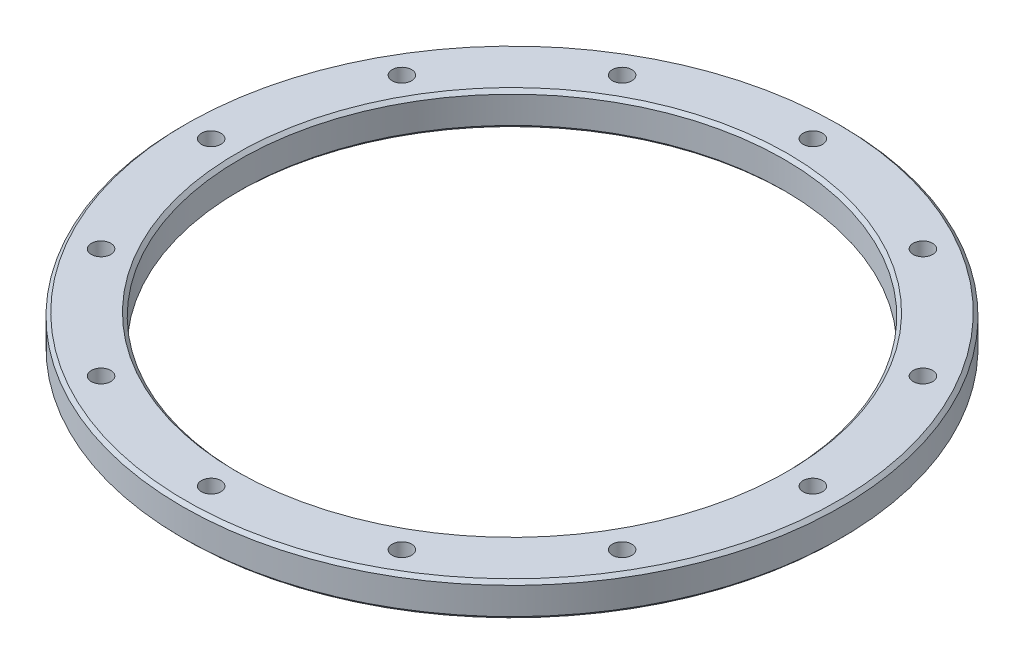
ISO-10303-21;
HEADER;
FILE_DESCRIPTION(('STEP AP214'),'2;1');
FILE_NAME('part.step','',(''),(''),'','','');
FILE_SCHEMA(('AUTOMOTIVE_DESIGN { 1 0 10303 214 1 1 1 1 }'));
ENDSEC;
DATA;
#1=APPLICATION_CONTEXT('core data for automotive mechanical design processes');
#2=APPLICATION_PROTOCOL_DEFINITION('international standard','automotive_design',2000,#1);
#3=PRODUCT_CONTEXT('',#1,'mechanical');
#4=PRODUCT('Part','Part','',(#3));
#5=PRODUCT_RELATED_PRODUCT_CATEGORY('part','',(#4));
#6=PRODUCT_DEFINITION_FORMATION('','',#4);
#7=PRODUCT_DEFINITION_CONTEXT('part definition',#1,'design');
#8=PRODUCT_DEFINITION('design','',#6,#7);
#9=PRODUCT_DEFINITION_SHAPE('','',#8);
#10=(LENGTH_UNIT() NAMED_UNIT(*) SI_UNIT(.MILLI.,.METRE.));
#11=(NAMED_UNIT(*) PLANE_ANGLE_UNIT() SI_UNIT($,.RADIAN.));
#12=(NAMED_UNIT(*) SI_UNIT($,.STERADIAN.) SOLID_ANGLE_UNIT());
#13=UNCERTAINTY_MEASURE_WITH_UNIT(LENGTH_MEASURE(1.E-05),#10,'distance_accuracy_value','');
#14=(GEOMETRIC_REPRESENTATION_CONTEXT(3) GLOBAL_UNCERTAINTY_ASSIGNED_CONTEXT((#13)) GLOBAL_UNIT_ASSIGNED_CONTEXT((#10,
#11,#12)) REPRESENTATION_CONTEXT('',''));
#15=CARTESIAN_POINT('',(0.,0.,0.));
#16=DIRECTION('',(0.,0.,1.));
#17=DIRECTION('',(1.,0.,0.));
#18=AXIS2_PLACEMENT_3D('',#15,#16,#17);
#19=CARTESIAN_POINT('',(0.,0.,0.));
#20=DIRECTION('',(0.,1.,0.));
#21=DIRECTION('',(0.,0.,1.));
#22=AXIS2_PLACEMENT_3D('',#19,#20,#21);
#23=CYLINDRICAL_SURFACE('',#22,61.9125);
#24=CARTESIAN_POINT('',(0.,5.71500000000006,0.));
#25=DIRECTION('',(0.,-1.,0.));
#26=DIRECTION('',(0.,0.,-1.));
#27=AXIS2_PLACEMENT_3D('',#24,#25,#26);
#28=CIRCLE('',#27,61.9125);
#29=CARTESIAN_POINT('',(0.,5.71500000000006,-61.9125));
#30=VERTEX_POINT('',#29);
#31=EDGE_CURVE('E10',#30,#30,#28,.T.);
#32=ORIENTED_EDGE('',*,*,#31,.T.);
#33=EDGE_LOOP('',(#32));
#34=FACE_BOUND('',#33,.T.);
#35=CARTESIAN_POINT('',(0.,0.635000000000059,0.));
#36=DIRECTION('',(0.,-1.,0.));
#37=DIRECTION('',(0.,0.,-1.));
#38=AXIS2_PLACEMENT_3D('',#35,#36,#37);
#39=CIRCLE('',#38,61.9125);
#40=CARTESIAN_POINT('',(0.,0.635000000000059,-61.9125));
#41=VERTEX_POINT('',#40);
#42=EDGE_CURVE('E57',#41,#41,#39,.F.);
#43=ORIENTED_EDGE('',*,*,#42,.T.);
#44=EDGE_LOOP('',(#43));
#45=FACE_BOUND('',#44,.T.);
#46=ADVANCED_FACE('F41',(#34,#45),#23,.T.);
#47=CARTESIAN_POINT('',(0.,0.,0.));
#48=DIRECTION('',(0.,-1.,0.));
#49=DIRECTION('',(0.,0.,-1.));
#50=AXIS2_PLACEMENT_3D('',#47,#48,#49);
#51=PLANE('',#50);
#52=CARTESIAN_POINT('',(0.,0.,0.));
#53=DIRECTION('',(0.,-1.,0.));
#54=DIRECTION('',(0.,0.,-1.));
#55=AXIS2_PLACEMENT_3D('',#52,#53,#54);
#56=CIRCLE('',#55,61.2774999999999);
#57=CARTESIAN_POINT('',(0.,0.,-61.2774999999999));
#58=VERTEX_POINT('',#57);
#59=EDGE_CURVE('E53',#58,#58,#56,.T.);
#60=ORIENTED_EDGE('',*,*,#59,.T.);
#61=EDGE_LOOP('',(#60));
#62=FACE_BOUND('',#61,.T.);
#63=CARTESIAN_POINT('',(-48.9434256948766,0.,28.2575000000015));
#64=DIRECTION('',(0.,-1.,0.));
#65=DIRECTION('',(0.,0.,-1.));
#66=AXIS2_PLACEMENT_3D('',#63,#64,#65);
#67=CIRCLE('',#66,1.83000000000001);
#68=CARTESIAN_POINT('',(-48.9434256948766,0.,26.4275000000015));
#69=VERTEX_POINT('',#68);
#70=EDGE_CURVE('E143',#69,#69,#67,.T.);
#71=ORIENTED_EDGE('',*,*,#70,.F.);
#72=EDGE_LOOP('',(#71));
#73=FACE_BOUND('',#72,.T.);
#74=CARTESIAN_POINT('',(-56.515,0.,1.63410951437015E-12));
#75=DIRECTION('',(0.,-1.,0.));
#76=DIRECTION('',(0.,0.,-1.));
#77=AXIS2_PLACEMENT_3D('',#74,#75,#76);
#78=CIRCLE('',#77,1.83000000000001);
#79=CARTESIAN_POINT('',(-56.515,0.,-1.82999999999838));
#80=VERTEX_POINT('',#79);
#81=EDGE_CURVE('E137',#80,#80,#78,.T.);
#82=ORIENTED_EDGE('',*,*,#81,.F.);
#83=EDGE_LOOP('',(#82));
#84=FACE_BOUND('',#83,.T.);
#85=CARTESIAN_POINT('',(-48.9434256948783,0.,-28.2574999999987));
#86=DIRECTION('',(0.,-1.,0.));
#87=DIRECTION('',(0.,0.,-1.));
#88=AXIS2_PLACEMENT_3D('',#85,#86,#87);
#89=CIRCLE('',#88,1.83000000000001);
#90=CARTESIAN_POINT('',(-48.9434256948783,0.,-30.0874999999987));
#91=VERTEX_POINT('',#90);
#92=EDGE_CURVE('E131',#91,#91,#89,.T.);
#93=ORIENTED_EDGE('',*,*,#92,.F.);
#94=EDGE_LOOP('',(#93));
#95=FACE_BOUND('',#94,.T.);
#96=CARTESIAN_POINT('',(-28.2575000000011,0.,-48.9434256948769));
#97=DIRECTION('',(0.,-1.,0.));
#98=DIRECTION('',(0.,0.,-1.));
#99=AXIS2_PLACEMENT_3D('',#96,#97,#98);
#100=CIRCLE('',#99,1.83000000000001);
#101=CARTESIAN_POINT('',(-28.2575000000011,0.,-50.7734256948769));
#102=VERTEX_POINT('',#101);
#103=EDGE_CURVE('E125',#102,#102,#100,.T.);
#104=ORIENTED_EDGE('',*,*,#103,.F.);
#105=EDGE_LOOP('',(#104));
#106=FACE_BOUND('',#105,.T.);
#107=CARTESIAN_POINT('',(-1.13450915328883E-12,0.,-56.515));
#108=DIRECTION('',(0.,-1.,0.));
#109=DIRECTION('',(0.,0.,-1.));
#110=AXIS2_PLACEMENT_3D('',#107,#108,#109);
#111=CIRCLE('',#110,1.83000000000001);
#112=CARTESIAN_POINT('',(-1.13450915328883E-12,0.,-58.345));
#113=VERTEX_POINT('',#112);
#114=EDGE_CURVE('E119',#113,#113,#111,.T.);
#115=ORIENTED_EDGE('',*,*,#114,.F.);
#116=EDGE_LOOP('',(#115));
#117=FACE_BOUND('',#116,.T.);
#118=CARTESIAN_POINT('',(28.2575,0.,-48.9434256948775));
#119=DIRECTION('',(0.,-1.,0.));
#120=DIRECTION('',(0.,0.,-1.));
#121=AXIS2_PLACEMENT_3D('',#118,#119,#120);
#122=CIRCLE('',#121,1.83000000000001);
#123=CARTESIAN_POINT('',(28.2575,0.,-50.7734256948775));
#124=VERTEX_POINT('',#123);
#125=EDGE_CURVE('E113',#124,#124,#122,.T.);
#126=ORIENTED_EDGE('',*,*,#125,.F.);
#127=EDGE_LOOP('',(#126));
#128=FACE_BOUND('',#127,.T.);
#129=CARTESIAN_POINT('',(48.9434256948771,0.,-28.2575000000007));
#130=DIRECTION('',(0.,-1.,0.));
#131=DIRECTION('',(0.,0.,-1.));
#132=AXIS2_PLACEMENT_3D('',#129,#130,#131);
#133=CIRCLE('',#132,1.83000000000001);
#134=CARTESIAN_POINT('',(48.9434256948771,0.,-30.0875000000007));
#135=VERTEX_POINT('',#134);
#136=EDGE_CURVE('E107',#135,#135,#133,.T.);
#137=ORIENTED_EDGE('',*,*,#136,.F.);
#138=EDGE_LOOP('',(#137));
#139=FACE_BOUND('',#138,.T.);
#140=CARTESIAN_POINT('',(56.515,0.,-6.41847686111419E-13));
#141=DIRECTION('',(0.,-1.,0.));
#142=DIRECTION('',(0.,0.,-1.));
#143=AXIS2_PLACEMENT_3D('',#140,#141,#142);
#144=CIRCLE('',#143,1.83000000000001);
#145=CARTESIAN_POINT('',(56.515,0.,-1.83000000000065));
#146=VERTEX_POINT('',#145);
#147=EDGE_CURVE('E101',#146,#146,#144,.T.);
#148=ORIENTED_EDGE('',*,*,#147,.F.);
#149=EDGE_LOOP('',(#148));
#150=FACE_BOUND('',#149,.T.);
#151=CARTESIAN_POINT('',(48.9434256948778,0.,28.2574999999996));
#152=DIRECTION('',(0.,-1.,0.));
#153=DIRECTION('',(0.,0.,-1.));
#154=AXIS2_PLACEMENT_3D('',#151,#152,#153);
#155=CIRCLE('',#154,1.83000000000001);
#156=CARTESIAN_POINT('',(48.9434256948778,0.,26.4274999999996));
#157=VERTEX_POINT('',#156);
#158=EDGE_CURVE('E95',#157,#157,#155,.T.);
#159=ORIENTED_EDGE('',*,*,#158,.F.);
#160=EDGE_LOOP('',(#159));
#161=FACE_BOUND('',#160,.T.);
#162=CARTESIAN_POINT('',(28.2575000000002,0.,48.9434256948774));
#163=DIRECTION('',(0.,-1.,0.));
#164=DIRECTION('',(0.,0.,-1.));
#165=AXIS2_PLACEMENT_3D('',#162,#163,#164);
#166=CIRCLE('',#165,1.83000000000001);
#167=CARTESIAN_POINT('',(28.2575000000002,0.,47.1134256948773));
#168=VERTEX_POINT('',#167);
#169=EDGE_CURVE('E89',#168,#168,#166,.T.);
#170=ORIENTED_EDGE('',*,*,#169,.F.);
#171=EDGE_LOOP('',(#170));
#172=FACE_BOUND('',#171,.T.);
#173=CARTESIAN_POINT('',(1.42247325030098E-13,0.,56.515));
#174=DIRECTION('',(0.,-1.,0.));
#175=DIRECTION('',(0.,0.,-1.));
#176=AXIS2_PLACEMENT_3D('',#173,#174,#175);
#177=CIRCLE('',#176,1.83000000000001);
#178=CARTESIAN_POINT('',(1.42247325030098E-13,0.,54.6849999999999));
#179=VERTEX_POINT('',#178);
#180=EDGE_CURVE('E83',#179,#179,#177,.T.);
#181=ORIENTED_EDGE('',*,*,#180,.F.);
#182=EDGE_LOOP('',(#181));
#183=FACE_BOUND('',#182,.T.);
#184=CARTESIAN_POINT('',(-28.2575,0.,48.9434256948775));
#185=DIRECTION('',(0.,-1.,0.));
#186=DIRECTION('',(0.,0.,-1.));
#187=AXIS2_PLACEMENT_3D('',#184,#185,#186);
#188=CIRCLE('',#187,1.83000000000001);
#189=CARTESIAN_POINT('',(-28.2575,0.,47.1134256948775));
#190=VERTEX_POINT('',#189);
#191=EDGE_CURVE('E77',#190,#190,#188,.T.);
#192=ORIENTED_EDGE('',*,*,#191,.F.);
#193=EDGE_LOOP('',(#192));
#194=FACE_BOUND('',#193,.T.);
#195=CARTESIAN_POINT('',(0.,0.,0.));
#196=DIRECTION('',(0.,-1.,0.));
#197=DIRECTION('',(0.,0.,-1.));
#198=AXIS2_PLACEMENT_3D('',#195,#196,#197);
#199=CIRCLE('',#198,51.7524999999999);
#200=CARTESIAN_POINT('',(0.,0.,-51.7524999999999));
#201=VERTEX_POINT('',#200);
#202=EDGE_CURVE('E71',#201,#201,#199,.F.);
#203=ORIENTED_EDGE('',*,*,#202,.T.);
#204=EDGE_LOOP('',(#203));
#205=FACE_BOUND('',#204,.T.);
#206=ADVANCED_FACE('F149',(#62,#73,#84,#95,#106,#117,#128,#139,#150,#161,#172,#183,#194,#205),
#51,.T.);
#207=CARTESIAN_POINT('',(0.,6.35,0.));
#208=DIRECTION('',(0.,-1.,0.));
#209=DIRECTION('',(0.,0.,-1.));
#210=AXIS2_PLACEMENT_3D('',#207,#208,#209);
#211=PLANE('',#210);
#212=CARTESIAN_POINT('',(0.,6.35,0.));
#213=DIRECTION('',(0.,-1.,0.));
#214=DIRECTION('',(0.,0.,-1.));
#215=AXIS2_PLACEMENT_3D('',#212,#213,#214);
#216=CIRCLE('',#215,61.2775000000001);
#217=CARTESIAN_POINT('',(0.,6.35,-61.2775000000001));
#218=VERTEX_POINT('',#217);
#219=EDGE_CURVE('E49',#218,#218,#216,.F.);
#220=ORIENTED_EDGE('',*,*,#219,.T.);
#221=EDGE_LOOP('',(#220));
#222=FACE_BOUND('',#221,.T.);
#223=CARTESIAN_POINT('',(-48.9434256948766,6.34999999999999,28.2575000000015));
#224=DIRECTION('',(0.,-1.,0.));
#225=DIRECTION('',(0.,0.,-1.));
#226=AXIS2_PLACEMENT_3D('',#223,#224,#225);
#227=CIRCLE('',#226,1.83000000000001);
#228=CARTESIAN_POINT('',(-48.9434256948766,6.34999999999999,26.4275000000015));
#229=VERTEX_POINT('',#228);
#230=EDGE_CURVE('E140',#229,#229,#227,.T.);
#231=ORIENTED_EDGE('',*,*,#230,.T.);
#232=EDGE_LOOP('',(#231));
#233=FACE_BOUND('',#232,.T.);
#234=CARTESIAN_POINT('',(-56.515,6.34999999999999,1.63410951437015E-12));
#235=DIRECTION('',(0.,-1.,0.));
#236=DIRECTION('',(0.,0.,-1.));
#237=AXIS2_PLACEMENT_3D('',#234,#235,#236);
#238=CIRCLE('',#237,1.83000000000001);
#239=CARTESIAN_POINT('',(-56.515,6.34999999999999,-1.82999999999838));
#240=VERTEX_POINT('',#239);
#241=EDGE_CURVE('E134',#240,#240,#238,.T.);
#242=ORIENTED_EDGE('',*,*,#241,.T.);
#243=EDGE_LOOP('',(#242));
#244=FACE_BOUND('',#243,.T.);
#245=CARTESIAN_POINT('',(-48.9434256948783,6.34999999999999,-28.2574999999987));
#246=DIRECTION('',(0.,-1.,0.));
#247=DIRECTION('',(0.,0.,-1.));
#248=AXIS2_PLACEMENT_3D('',#245,#246,#247);
#249=CIRCLE('',#248,1.83000000000001);
#250=CARTESIAN_POINT('',(-48.9434256948783,6.34999999999999,-30.0874999999987));
#251=VERTEX_POINT('',#250);
#252=EDGE_CURVE('E128',#251,#251,#249,.T.);
#253=ORIENTED_EDGE('',*,*,#252,.T.);
#254=EDGE_LOOP('',(#253));
#255=FACE_BOUND('',#254,.T.);
#256=CARTESIAN_POINT('',(-28.2575000000011,6.34999999999999,-48.9434256948769));
#257=DIRECTION('',(0.,-1.,0.));
#258=DIRECTION('',(0.,0.,-1.));
#259=AXIS2_PLACEMENT_3D('',#256,#257,#258);
#260=CIRCLE('',#259,1.83000000000001);
#261=CARTESIAN_POINT('',(-28.2575000000011,6.34999999999999,-50.7734256948769));
#262=VERTEX_POINT('',#261);
#263=EDGE_CURVE('E122',#262,#262,#260,.T.);
#264=ORIENTED_EDGE('',*,*,#263,.T.);
#265=EDGE_LOOP('',(#264));
#266=FACE_BOUND('',#265,.T.);
#267=CARTESIAN_POINT('',(-1.13450915328883E-12,6.34999999999999,-56.515));
#268=DIRECTION('',(0.,-1.,0.));
#269=DIRECTION('',(0.,0.,-1.));
#270=AXIS2_PLACEMENT_3D('',#267,#268,#269);
#271=CIRCLE('',#270,1.83000000000001);
#272=CARTESIAN_POINT('',(-1.13450915328883E-12,6.34999999999999,-58.345));
#273=VERTEX_POINT('',#272);
#274=EDGE_CURVE('E116',#273,#273,#271,.T.);
#275=ORIENTED_EDGE('',*,*,#274,.T.);
#276=EDGE_LOOP('',(#275));
#277=FACE_BOUND('',#276,.T.);
#278=CARTESIAN_POINT('',(28.2575,6.34999999999999,-48.9434256948775));
#279=DIRECTION('',(0.,-1.,0.));
#280=DIRECTION('',(0.,0.,-1.));
#281=AXIS2_PLACEMENT_3D('',#278,#279,#280);
#282=CIRCLE('',#281,1.83000000000001);
#283=CARTESIAN_POINT('',(28.2575,6.34999999999999,-50.7734256948775));
#284=VERTEX_POINT('',#283);
#285=EDGE_CURVE('E110',#284,#284,#282,.T.);
#286=ORIENTED_EDGE('',*,*,#285,.T.);
#287=EDGE_LOOP('',(#286));
#288=FACE_BOUND('',#287,.T.);
#289=CARTESIAN_POINT('',(48.9434256948771,6.34999999999999,-28.2575000000007));
#290=DIRECTION('',(0.,-1.,0.));
#291=DIRECTION('',(0.,0.,-1.));
#292=AXIS2_PLACEMENT_3D('',#289,#290,#291);
#293=CIRCLE('',#292,1.83000000000001);
#294=CARTESIAN_POINT('',(48.9434256948771,6.34999999999999,-30.0875000000007));
#295=VERTEX_POINT('',#294);
#296=EDGE_CURVE('E104',#295,#295,#293,.T.);
#297=ORIENTED_EDGE('',*,*,#296,.T.);
#298=EDGE_LOOP('',(#297));
#299=FACE_BOUND('',#298,.T.);
#300=CARTESIAN_POINT('',(56.515,6.34999999999999,-6.41847686111419E-13));
#301=DIRECTION('',(0.,-1.,0.));
#302=DIRECTION('',(0.,0.,-1.));
#303=AXIS2_PLACEMENT_3D('',#300,#301,#302);
#304=CIRCLE('',#303,1.83000000000001);
#305=CARTESIAN_POINT('',(56.515,6.34999999999999,-1.83000000000065));
#306=VERTEX_POINT('',#305);
#307=EDGE_CURVE('E98',#306,#306,#304,.T.);
#308=ORIENTED_EDGE('',*,*,#307,.T.);
#309=EDGE_LOOP('',(#308));
#310=FACE_BOUND('',#309,.T.);
#311=CARTESIAN_POINT('',(48.9434256948778,6.34999999999999,28.2574999999996));
#312=DIRECTION('',(0.,-1.,0.));
#313=DIRECTION('',(0.,0.,-1.));
#314=AXIS2_PLACEMENT_3D('',#311,#312,#313);
#315=CIRCLE('',#314,1.83000000000001);
#316=CARTESIAN_POINT('',(48.9434256948778,6.34999999999999,26.4274999999996));
#317=VERTEX_POINT('',#316);
#318=EDGE_CURVE('E92',#317,#317,#315,.T.);
#319=ORIENTED_EDGE('',*,*,#318,.T.);
#320=EDGE_LOOP('',(#319));
#321=FACE_BOUND('',#320,.T.);
#322=CARTESIAN_POINT('',(28.2575000000002,6.34999999999999,48.9434256948774));
#323=DIRECTION('',(0.,-1.,0.));
#324=DIRECTION('',(0.,0.,-1.));
#325=AXIS2_PLACEMENT_3D('',#322,#323,#324);
#326=CIRCLE('',#325,1.83000000000001);
#327=CARTESIAN_POINT('',(28.2575000000002,6.34999999999999,47.1134256948773));
#328=VERTEX_POINT('',#327);
#329=EDGE_CURVE('E86',#328,#328,#326,.T.);
#330=ORIENTED_EDGE('',*,*,#329,.T.);
#331=EDGE_LOOP('',(#330));
#332=FACE_BOUND('',#331,.T.);
#333=CARTESIAN_POINT('',(1.42247325030098E-13,6.34999999999999,56.515));
#334=DIRECTION('',(0.,-1.,0.));
#335=DIRECTION('',(0.,0.,-1.));
#336=AXIS2_PLACEMENT_3D('',#333,#334,#335);
#337=CIRCLE('',#336,1.83000000000001);
#338=CARTESIAN_POINT('',(1.42247325030098E-13,6.34999999999999,54.6849999999999));
#339=VERTEX_POINT('',#338);
#340=EDGE_CURVE('E80',#339,#339,#337,.T.);
#341=ORIENTED_EDGE('',*,*,#340,.T.);
#342=EDGE_LOOP('',(#341));
#343=FACE_BOUND('',#342,.T.);
#344=CARTESIAN_POINT('',(-28.2575,6.34999999999999,48.9434256948775));
#345=DIRECTION('',(0.,-1.,0.));
#346=DIRECTION('',(0.,0.,-1.));
#347=AXIS2_PLACEMENT_3D('',#344,#345,#346);
#348=CIRCLE('',#347,1.83000000000001);
#349=CARTESIAN_POINT('',(-28.2575,6.34999999999999,47.1134256948775));
#350=VERTEX_POINT('',#349);
#351=EDGE_CURVE('E74',#350,#350,#348,.T.);
#352=ORIENTED_EDGE('',*,*,#351,.T.);
#353=EDGE_LOOP('',(#352));
#354=FACE_BOUND('',#353,.T.);
#355=CARTESIAN_POINT('',(0.,6.35,0.));
#356=DIRECTION('',(0.,-1.,0.));
#357=DIRECTION('',(0.,0.,-1.));
#358=AXIS2_PLACEMENT_3D('',#355,#356,#357);
#359=CIRCLE('',#358,51.7525000000001);
#360=CARTESIAN_POINT('',(0.,6.35,-51.7525000000001));
#361=VERTEX_POINT('',#360);
#362=EDGE_CURVE('E62',#361,#361,#359,.T.);
#363=ORIENTED_EDGE('',*,*,#362,.T.);
#364=EDGE_LOOP('',(#363));
#365=FACE_BOUND('',#364,.T.);
#366=ADVANCED_FACE('F152',(#222,#233,#244,#255,#266,#277,#288,#299,#310,#321,#332,#343,#354,
#365),#211,.F.);
#367=CARTESIAN_POINT('',(0.,0.,0.));
#368=DIRECTION('',(0.,1.,0.));
#369=DIRECTION('',(0.,0.,1.));
#370=AXIS2_PLACEMENT_3D('',#367,#368,#369);
#371=CYLINDRICAL_SURFACE('',#370,51.1175);
#372=CARTESIAN_POINT('',(0.,5.71499999999997,0.));
#373=DIRECTION('',(0.,-1.,0.));
#374=DIRECTION('',(0.,0.,-1.));
#375=AXIS2_PLACEMENT_3D('',#372,#373,#374);
#376=CIRCLE('',#375,51.1175);
#377=CARTESIAN_POINT('',(0.,5.71499999999997,-51.1175));
#378=VERTEX_POINT('',#377);
#379=EDGE_CURVE('E65',#378,#378,#376,.F.);
#380=ORIENTED_EDGE('',*,*,#379,.T.);
#381=EDGE_LOOP('',(#380));
#382=FACE_BOUND('',#381,.T.);
#383=CARTESIAN_POINT('',(0.,0.634999999999934,0.));
#384=DIRECTION('',(0.,-1.,0.));
#385=DIRECTION('',(0.,0.,-1.));
#386=AXIS2_PLACEMENT_3D('',#383,#384,#385);
#387=CIRCLE('',#386,51.1175);
#388=CARTESIAN_POINT('',(0.,0.634999999999934,-51.1175));
#389=VERTEX_POINT('',#388);
#390=EDGE_CURVE('E68',#389,#389,#387,.T.);
#391=ORIENTED_EDGE('',*,*,#390,.T.);
#392=EDGE_LOOP('',(#391));
#393=FACE_BOUND('',#392,.T.);
#394=ADVANCED_FACE('F182',(#382,#393),#371,.F.);
#395=CARTESIAN_POINT('',(0.,0.,0.));
#396=DIRECTION('',(0.,-1.,0.));
#397=DIRECTION('',(0.,0.,-1.));
#398=AXIS2_PLACEMENT_3D('',#395,#396,#397);
#399=CONICAL_SURFACE('',#398,51.7524999999999,0.785398163397448);
#400=ORIENTED_EDGE('',*,*,#390,.F.);
#401=EDGE_LOOP('',(#400));
#402=FACE_BOUND('',#401,.T.);
#403=ORIENTED_EDGE('',*,*,#202,.F.);
#404=EDGE_LOOP('',(#403));
#405=FACE_BOUND('',#404,.T.);
#406=ADVANCED_FACE('F179',(#402,#405),#399,.F.);
#407=CARTESIAN_POINT('',(0.,5.71499999999997,0.));
#408=DIRECTION('',(0.,1.,0.));
#409=DIRECTION('',(0.,0.,1.));
#410=AXIS2_PLACEMENT_3D('',#407,#408,#409);
#411=CONICAL_SURFACE('',#410,51.1175,0.78539816339747);
#412=ORIENTED_EDGE('',*,*,#362,.F.);
#413=EDGE_LOOP('',(#412));
#414=FACE_BOUND('',#413,.T.);
#415=ORIENTED_EDGE('',*,*,#379,.F.);
#416=EDGE_LOOP('',(#415));
#417=FACE_BOUND('',#416,.T.);
#418=ADVANCED_FACE('F181',(#414,#417),#411,.F.);
#419=CARTESIAN_POINT('',(-28.2575,0.,48.9434256948775));
#420=DIRECTION('',(0.,-1.,0.));
#421=DIRECTION('',(0.,0.,-1.));
#422=AXIS2_PLACEMENT_3D('',#419,#420,#421);
#423=CYLINDRICAL_SURFACE('',#422,1.83000000000001);
#424=ORIENTED_EDGE('',*,*,#351,.F.);
#425=EDGE_LOOP('',(#424));
#426=FACE_BOUND('',#425,.T.);
#427=ORIENTED_EDGE('',*,*,#191,.T.);
#428=EDGE_LOOP('',(#427));
#429=FACE_BOUND('',#428,.T.);
#430=ADVANCED_FACE('F189',(#426,#429),#423,.F.);
#431=CARTESIAN_POINT('',(1.42247325030098E-13,0.,56.515));
#432=DIRECTION('',(0.,-1.,0.));
#433=DIRECTION('',(0.,0.,-1.));
#434=AXIS2_PLACEMENT_3D('',#431,#432,#433);
#435=CYLINDRICAL_SURFACE('',#434,1.83000000000001);
#436=ORIENTED_EDGE('',*,*,#340,.F.);
#437=EDGE_LOOP('',(#436));
#438=FACE_BOUND('',#437,.T.);
#439=ORIENTED_EDGE('',*,*,#180,.T.);
#440=EDGE_LOOP('',(#439));
#441=FACE_BOUND('',#440,.T.);
#442=ADVANCED_FACE('F206',(#438,#441),#435,.F.);
#443=CARTESIAN_POINT('',(28.2575000000002,0.,48.9434256948774));
#444=DIRECTION('',(0.,-1.,0.));
#445=DIRECTION('',(0.,0.,-1.));
#446=AXIS2_PLACEMENT_3D('',#443,#444,#445);
#447=CYLINDRICAL_SURFACE('',#446,1.83000000000001);
#448=ORIENTED_EDGE('',*,*,#329,.F.);
#449=EDGE_LOOP('',(#448));
#450=FACE_BOUND('',#449,.T.);
#451=ORIENTED_EDGE('',*,*,#169,.T.);
#452=EDGE_LOOP('',(#451));
#453=FACE_BOUND('',#452,.T.);
#454=ADVANCED_FACE('F210',(#450,#453),#447,.F.);
#455=CARTESIAN_POINT('',(48.9434256948778,0.,28.2574999999996));
#456=DIRECTION('',(0.,-1.,0.));
#457=DIRECTION('',(0.,0.,-1.));
#458=AXIS2_PLACEMENT_3D('',#455,#456,#457);
#459=CYLINDRICAL_SURFACE('',#458,1.83000000000001);
#460=ORIENTED_EDGE('',*,*,#318,.F.);
#461=EDGE_LOOP('',(#460));
#462=FACE_BOUND('',#461,.T.);
#463=ORIENTED_EDGE('',*,*,#158,.T.);
#464=EDGE_LOOP('',(#463));
#465=FACE_BOUND('',#464,.T.);
#466=ADVANCED_FACE('F214',(#462,#465),#459,.F.);
#467=CARTESIAN_POINT('',(56.515,0.,-6.41847686111419E-13));
#468=DIRECTION('',(0.,-1.,0.));
#469=DIRECTION('',(0.,0.,-1.));
#470=AXIS2_PLACEMENT_3D('',#467,#468,#469);
#471=CYLINDRICAL_SURFACE('',#470,1.83000000000001);
#472=ORIENTED_EDGE('',*,*,#307,.F.);
#473=EDGE_LOOP('',(#472));
#474=FACE_BOUND('',#473,.T.);
#475=ORIENTED_EDGE('',*,*,#147,.T.);
#476=EDGE_LOOP('',(#475));
#477=FACE_BOUND('',#476,.T.);
#478=ADVANCED_FACE('F218',(#474,#477),#471,.F.);
#479=CARTESIAN_POINT('',(48.9434256948771,0.,-28.2575000000007));
#480=DIRECTION('',(0.,-1.,0.));
#481=DIRECTION('',(0.,0.,-1.));
#482=AXIS2_PLACEMENT_3D('',#479,#480,#481);
#483=CYLINDRICAL_SURFACE('',#482,1.83000000000001);
#484=ORIENTED_EDGE('',*,*,#296,.F.);
#485=EDGE_LOOP('',(#484));
#486=FACE_BOUND('',#485,.T.);
#487=ORIENTED_EDGE('',*,*,#136,.T.);
#488=EDGE_LOOP('',(#487));
#489=FACE_BOUND('',#488,.T.);
#490=ADVANCED_FACE('F222',(#486,#489),#483,.F.);
#491=CARTESIAN_POINT('',(28.2575,0.,-48.9434256948775));
#492=DIRECTION('',(0.,-1.,0.));
#493=DIRECTION('',(0.,0.,-1.));
#494=AXIS2_PLACEMENT_3D('',#491,#492,#493);
#495=CYLINDRICAL_SURFACE('',#494,1.83000000000001);
#496=ORIENTED_EDGE('',*,*,#285,.F.);
#497=EDGE_LOOP('',(#496));
#498=FACE_BOUND('',#497,.T.);
#499=ORIENTED_EDGE('',*,*,#125,.T.);
#500=EDGE_LOOP('',(#499));
#501=FACE_BOUND('',#500,.T.);
#502=ADVANCED_FACE('F226',(#498,#501),#495,.F.);
#503=CARTESIAN_POINT('',(-1.13450915328883E-12,0.,-56.515));
#504=DIRECTION('',(0.,-1.,0.));
#505=DIRECTION('',(0.,0.,-1.));
#506=AXIS2_PLACEMENT_3D('',#503,#504,#505);
#507=CYLINDRICAL_SURFACE('',#506,1.83000000000001);
#508=ORIENTED_EDGE('',*,*,#274,.F.);
#509=EDGE_LOOP('',(#508));
#510=FACE_BOUND('',#509,.T.);
#511=ORIENTED_EDGE('',*,*,#114,.T.);
#512=EDGE_LOOP('',(#511));
#513=FACE_BOUND('',#512,.T.);
#514=ADVANCED_FACE('F230',(#510,#513),#507,.F.);
#515=CARTESIAN_POINT('',(-28.2575000000011,0.,-48.9434256948769));
#516=DIRECTION('',(0.,-1.,0.));
#517=DIRECTION('',(0.,0.,-1.));
#518=AXIS2_PLACEMENT_3D('',#515,#516,#517);
#519=CYLINDRICAL_SURFACE('',#518,1.83000000000001);
#520=ORIENTED_EDGE('',*,*,#263,.F.);
#521=EDGE_LOOP('',(#520));
#522=FACE_BOUND('',#521,.T.);
#523=ORIENTED_EDGE('',*,*,#103,.T.);
#524=EDGE_LOOP('',(#523));
#525=FACE_BOUND('',#524,.T.);
#526=ADVANCED_FACE('F234',(#522,#525),#519,.F.);
#527=CARTESIAN_POINT('',(-48.9434256948783,0.,-28.2574999999987));
#528=DIRECTION('',(0.,-1.,0.));
#529=DIRECTION('',(0.,0.,-1.));
#530=AXIS2_PLACEMENT_3D('',#527,#528,#529);
#531=CYLINDRICAL_SURFACE('',#530,1.83000000000001);
#532=ORIENTED_EDGE('',*,*,#252,.F.);
#533=EDGE_LOOP('',(#532));
#534=FACE_BOUND('',#533,.T.);
#535=ORIENTED_EDGE('',*,*,#92,.T.);
#536=EDGE_LOOP('',(#535));
#537=FACE_BOUND('',#536,.T.);
#538=ADVANCED_FACE('F238',(#534,#537),#531,.F.);
#539=CARTESIAN_POINT('',(-56.515,0.,1.63410951437015E-12));
#540=DIRECTION('',(0.,-1.,0.));
#541=DIRECTION('',(0.,0.,-1.));
#542=AXIS2_PLACEMENT_3D('',#539,#540,#541);
#543=CYLINDRICAL_SURFACE('',#542,1.83000000000001);
#544=ORIENTED_EDGE('',*,*,#241,.F.);
#545=EDGE_LOOP('',(#544));
#546=FACE_BOUND('',#545,.T.);
#547=ORIENTED_EDGE('',*,*,#81,.T.);
#548=EDGE_LOOP('',(#547));
#549=FACE_BOUND('',#548,.T.);
#550=ADVANCED_FACE('F242',(#546,#549),#543,.F.);
#551=CARTESIAN_POINT('',(-48.9434256948766,0.,28.2575000000015));
#552=DIRECTION('',(0.,-1.,0.));
#553=DIRECTION('',(0.,0.,-1.));
#554=AXIS2_PLACEMENT_3D('',#551,#552,#553);
#555=CYLINDRICAL_SURFACE('',#554,1.83000000000001);
#556=ORIENTED_EDGE('',*,*,#230,.F.);
#557=EDGE_LOOP('',(#556));
#558=FACE_BOUND('',#557,.T.);
#559=ORIENTED_EDGE('',*,*,#70,.T.);
#560=EDGE_LOOP('',(#559));
#561=FACE_BOUND('',#560,.T.);
#562=ADVANCED_FACE('F147',(#558,#561),#555,.F.);
#563=CARTESIAN_POINT('',(0.,0.635000000000059,0.));
#564=DIRECTION('',(0.,1.,0.));
#565=DIRECTION('',(0.,0.,1.));
#566=AXIS2_PLACEMENT_3D('',#563,#564,#565);
#567=CONICAL_SURFACE('',#566,61.9125,0.785398163397448);
#568=ORIENTED_EDGE('',*,*,#59,.F.);
#569=EDGE_LOOP('',(#568));
#570=FACE_BOUND('',#569,.T.);
#571=ORIENTED_EDGE('',*,*,#42,.F.);
#572=EDGE_LOOP('',(#571));
#573=FACE_BOUND('',#572,.T.);
#574=ADVANCED_FACE('F248',(#570,#573),#567,.T.);
#575=CARTESIAN_POINT('',(0.,6.35,0.));
#576=DIRECTION('',(0.,-1.,0.));
#577=DIRECTION('',(0.,0.,-1.));
#578=AXIS2_PLACEMENT_3D('',#575,#576,#577);
#579=CONICAL_SURFACE('',#578,61.2775000000001,0.785398163397454);
#580=ORIENTED_EDGE('',*,*,#31,.F.);
#581=EDGE_LOOP('',(#580));
#582=FACE_BOUND('',#581,.T.);
#583=ORIENTED_EDGE('',*,*,#219,.F.);
#584=EDGE_LOOP('',(#583));
#585=FACE_BOUND('',#584,.T.);
#586=ADVANCED_FACE('F44',(#582,#585),#579,.T.);
#587=CLOSED_SHELL('',(#46,#206,#366,#394,#406,#418,#430,#442,#454,#466,#478,#490,#502,#514,#526,
#538,#550,#562,#574,#586));
#588=MANIFOLD_SOLID_BREP('B2',#587);
#589=ADVANCED_BREP_SHAPE_REPRESENTATION('',(#18,#588),#14);
#590=SHAPE_DEFINITION_REPRESENTATION(#9,#589);
ENDSEC;
END-ISO-10303-21;
